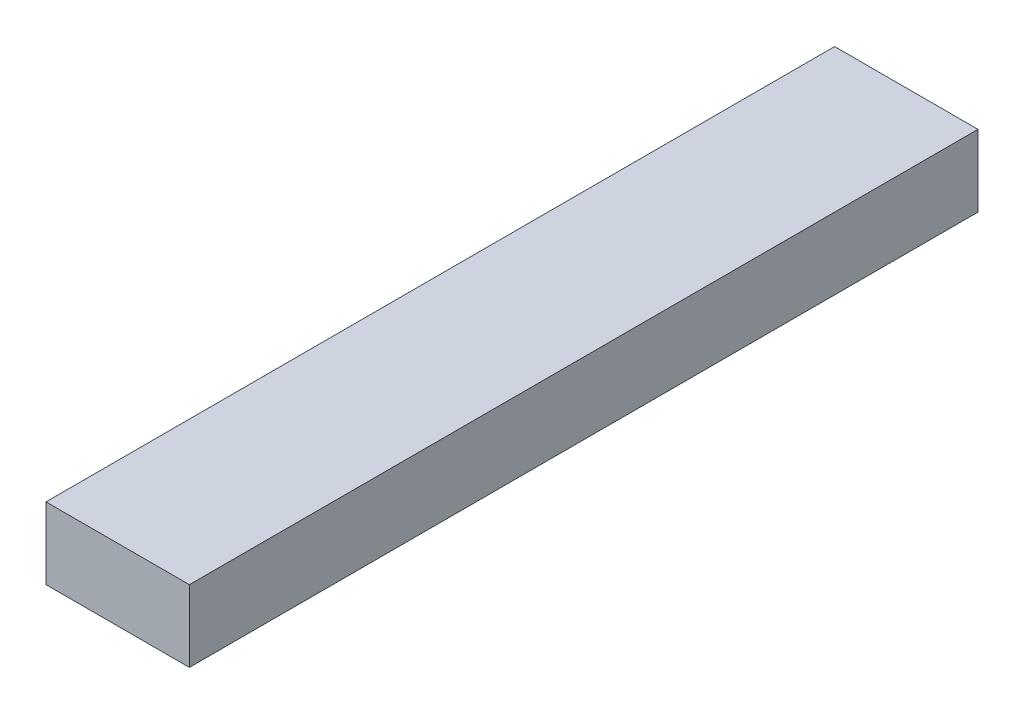
ISO-10303-21;
HEADER;
FILE_DESCRIPTION(('STEP AP214'),'2;1');
FILE_NAME('part.step','',(''),(''),'','','');
FILE_SCHEMA(('AUTOMOTIVE_DESIGN { 1 0 10303 214 1 1 1 1 }'));
ENDSEC;
DATA;
#1=APPLICATION_CONTEXT('core data for automotive mechanical design processes');
#2=APPLICATION_PROTOCOL_DEFINITION('international standard','automotive_design',2000,#1);
#3=PRODUCT_CONTEXT('',#1,'mechanical');
#4=PRODUCT('Part','Part','',(#3));
#5=PRODUCT_RELATED_PRODUCT_CATEGORY('part','',(#4));
#6=PRODUCT_DEFINITION_FORMATION('','',#4);
#7=PRODUCT_DEFINITION_CONTEXT('part definition',#1,'design');
#8=PRODUCT_DEFINITION('design','',#6,#7);
#9=PRODUCT_DEFINITION_SHAPE('','',#8);
#10=(LENGTH_UNIT() NAMED_UNIT(*) SI_UNIT(.MILLI.,.METRE.));
#11=(NAMED_UNIT(*) PLANE_ANGLE_UNIT() SI_UNIT($,.RADIAN.));
#12=(NAMED_UNIT(*) SI_UNIT($,.STERADIAN.) SOLID_ANGLE_UNIT());
#13=UNCERTAINTY_MEASURE_WITH_UNIT(LENGTH_MEASURE(1.E-05),#10,'distance_accuracy_value','');
#14=(GEOMETRIC_REPRESENTATION_CONTEXT(3) GLOBAL_UNCERTAINTY_ASSIGNED_CONTEXT((#13)) GLOBAL_UNIT_ASSIGNED_CONTEXT((#10,
#11,#12)) REPRESENTATION_CONTEXT('',''));
#15=CARTESIAN_POINT('',(0.,0.,0.));
#16=DIRECTION('',(0.,0.,1.));
#17=DIRECTION('',(1.,0.,0.));
#18=AXIS2_PLACEMENT_3D('',#15,#16,#17);
#19=CARTESIAN_POINT('',(-10.,10.,-55.));
#20=DIRECTION('',(1.,0.,0.));
#21=DIRECTION('',(0.,0.,-1.));
#22=AXIS2_PLACEMENT_3D('',#19,#20,#21);
#23=PLANE('',#22);
#24=DIRECTION('',(0.,0.,1.));
#25=VECTOR('',#24,1.);
#26=CARTESIAN_POINT('',(-10.,0.,-55.));
#27=LINE('',#26,#25);
#28=CARTESIAN_POINT('',(-10.,0.,-55.));
#29=VERTEX_POINT('',#28);
#30=CARTESIAN_POINT('',(-9.99999999999999,0.,55.));
#31=VERTEX_POINT('',#30);
#32=EDGE_CURVE('E95',#29,#31,#27,.T.);
#33=ORIENTED_EDGE('',*,*,#32,.T.);
#34=DIRECTION('',(0.,-1.,0.));
#35=VECTOR('',#34,1.);
#36=CARTESIAN_POINT('',(-9.99999999999999,10.,55.));
#37=LINE('',#36,#35);
#38=CARTESIAN_POINT('',(-9.99999999999999,10.,55.));
#39=VERTEX_POINT('',#38);
#40=EDGE_CURVE('E11',#39,#31,#37,.T.);
#41=ORIENTED_EDGE('',*,*,#40,.F.);
#42=DIRECTION('',(0.,0.,1.));
#43=VECTOR('',#42,1.);
#44=CARTESIAN_POINT('',(-10.,10.,-55.));
#45=LINE('',#44,#43);
#46=CARTESIAN_POINT('',(-10.,10.,-55.));
#47=VERTEX_POINT('',#46);
#48=EDGE_CURVE('E83',#47,#39,#45,.T.);
#49=ORIENTED_EDGE('',*,*,#48,.F.);
#50=DIRECTION('',(0.,-1.,0.));
#51=VECTOR('',#50,1.);
#52=CARTESIAN_POINT('',(-10.,10.,-55.));
#53=LINE('',#52,#51);
#54=EDGE_CURVE('E91',#47,#29,#53,.T.);
#55=ORIENTED_EDGE('',*,*,#54,.T.);
#56=EDGE_LOOP('',(#33,#41,#49,#55));
#57=FACE_BOUND('',#56,.T.);
#58=ADVANCED_FACE('F32',(#57),#23,.F.);
#59=CARTESIAN_POINT('',(-9.99999999999999,10.,55.));
#60=DIRECTION('',(0.,0.,-1.));
#61=DIRECTION('',(-1.,0.,0.));
#62=AXIS2_PLACEMENT_3D('',#59,#60,#61);
#63=PLANE('',#62);
#64=DIRECTION('',(1.,0.,0.));
#65=VECTOR('',#64,1.);
#66=CARTESIAN_POINT('',(-9.99999999999999,0.,55.));
#67=LINE('',#66,#65);
#68=CARTESIAN_POINT('',(10.,0.,55.));
#69=VERTEX_POINT('',#68);
#70=EDGE_CURVE('E87',#31,#69,#67,.T.);
#71=ORIENTED_EDGE('',*,*,#70,.T.);
#72=DIRECTION('',(0.,-1.,0.));
#73=VECTOR('',#72,1.);
#74=CARTESIAN_POINT('',(10.,10.,55.));
#75=LINE('',#74,#73);
#76=CARTESIAN_POINT('',(10.,10.,55.));
#77=VERTEX_POINT('',#76);
#78=EDGE_CURVE('E40',#77,#69,#75,.T.);
#79=ORIENTED_EDGE('',*,*,#78,.F.);
#80=DIRECTION('',(1.,0.,0.));
#81=VECTOR('',#80,1.);
#82=CARTESIAN_POINT('',(-9.99999999999999,10.,55.));
#83=LINE('',#82,#81);
#84=EDGE_CURVE('E78',#39,#77,#83,.T.);
#85=ORIENTED_EDGE('',*,*,#84,.F.);
#86=ORIENTED_EDGE('',*,*,#40,.T.);
#87=EDGE_LOOP('',(#71,#79,#85,#86));
#88=FACE_BOUND('',#87,.T.);
#89=ADVANCED_FACE('F86',(#88),#63,.F.);
#90=CARTESIAN_POINT('',(10.,10.,-55.));
#91=DIRECTION('',(-1.,0.,0.));
#92=DIRECTION('',(0.,0.,1.));
#93=AXIS2_PLACEMENT_3D('',#90,#91,#92);
#94=PLANE('',#93);
#95=DIRECTION('',(0.,0.,-1.));
#96=VECTOR('',#95,1.);
#97=CARTESIAN_POINT('',(10.,0.,-55.));
#98=LINE('',#97,#96);
#99=CARTESIAN_POINT('',(10.,0.,-55.));
#100=VERTEX_POINT('',#99);
#101=EDGE_CURVE('E65',#69,#100,#98,.T.);
#102=ORIENTED_EDGE('',*,*,#101,.T.);
#103=DIRECTION('',(0.,-1.,0.));
#104=VECTOR('',#103,1.);
#105=CARTESIAN_POINT('',(10.,10.,-55.));
#106=LINE('',#105,#104);
#107=CARTESIAN_POINT('',(10.,10.,-55.));
#108=VERTEX_POINT('',#107);
#109=EDGE_CURVE('E88',#108,#100,#106,.T.);
#110=ORIENTED_EDGE('',*,*,#109,.F.);
#111=DIRECTION('',(0.,0.,-1.));
#112=VECTOR('',#111,1.);
#113=CARTESIAN_POINT('',(10.,10.,-55.));
#114=LINE('',#113,#112);
#115=EDGE_CURVE('E81',#77,#108,#114,.T.);
#116=ORIENTED_EDGE('',*,*,#115,.F.);
#117=ORIENTED_EDGE('',*,*,#78,.T.);
#118=EDGE_LOOP('',(#102,#110,#116,#117));
#119=FACE_BOUND('',#118,.T.);
#120=ADVANCED_FACE('F89',(#119),#94,.F.);
#121=CARTESIAN_POINT('',(-10.,10.,-55.));
#122=DIRECTION('',(0.,0.,1.));
#123=DIRECTION('',(1.,0.,0.));
#124=AXIS2_PLACEMENT_3D('',#121,#122,#123);
#125=PLANE('',#124);
#126=DIRECTION('',(-1.,0.,0.));
#127=VECTOR('',#126,1.);
#128=CARTESIAN_POINT('',(-10.,0.,-55.));
#129=LINE('',#128,#127);
#130=EDGE_CURVE('E71',#100,#29,#129,.T.);
#131=ORIENTED_EDGE('',*,*,#130,.T.);
#132=ORIENTED_EDGE('',*,*,#54,.F.);
#133=DIRECTION('',(-1.,0.,0.));
#134=VECTOR('',#133,1.);
#135=CARTESIAN_POINT('',(-10.,10.,-55.));
#136=LINE('',#135,#134);
#137=EDGE_CURVE('E48',#108,#47,#136,.T.);
#138=ORIENTED_EDGE('',*,*,#137,.F.);
#139=ORIENTED_EDGE('',*,*,#109,.T.);
#140=EDGE_LOOP('',(#131,#132,#138,#139));
#141=FACE_BOUND('',#140,.T.);
#142=ADVANCED_FACE('F102',(#141),#125,.F.);
#143=CARTESIAN_POINT('',(0.,10.,0.));
#144=DIRECTION('',(0.,1.,0.));
#145=DIRECTION('',(0.,0.,1.));
#146=AXIS2_PLACEMENT_3D('',#143,#144,#145);
#147=PLANE('',#146);
#148=ORIENTED_EDGE('',*,*,#48,.T.);
#149=ORIENTED_EDGE('',*,*,#84,.T.);
#150=ORIENTED_EDGE('',*,*,#115,.T.);
#151=ORIENTED_EDGE('',*,*,#137,.T.);
#152=EDGE_LOOP('',(#148,#149,#150,#151));
#153=FACE_BOUND('',#152,.T.);
#154=ADVANCED_FACE('F79',(#153),#147,.T.);
#155=CARTESIAN_POINT('',(0.,0.,0.));
#156=DIRECTION('',(0.,1.,0.));
#157=DIRECTION('',(0.,0.,1.));
#158=AXIS2_PLACEMENT_3D('',#155,#156,#157);
#159=PLANE('',#158);
#160=ORIENTED_EDGE('',*,*,#32,.F.);
#161=ORIENTED_EDGE('',*,*,#130,.F.);
#162=ORIENTED_EDGE('',*,*,#101,.F.);
#163=ORIENTED_EDGE('',*,*,#70,.F.);
#164=EDGE_LOOP('',(#160,#161,#162,#163));
#165=FACE_BOUND('',#164,.T.);
#166=ADVANCED_FACE('F105',(#165),#159,.F.);
#167=CLOSED_SHELL('',(#58,#89,#120,#142,#154,#166));
#168=MANIFOLD_SOLID_BREP('B2',#167);
#169=ADVANCED_BREP_SHAPE_REPRESENTATION('',(#18,#168),#14);
#170=SHAPE_DEFINITION_REPRESENTATION(#9,#169);
ENDSEC;
END-ISO-10303-21;
